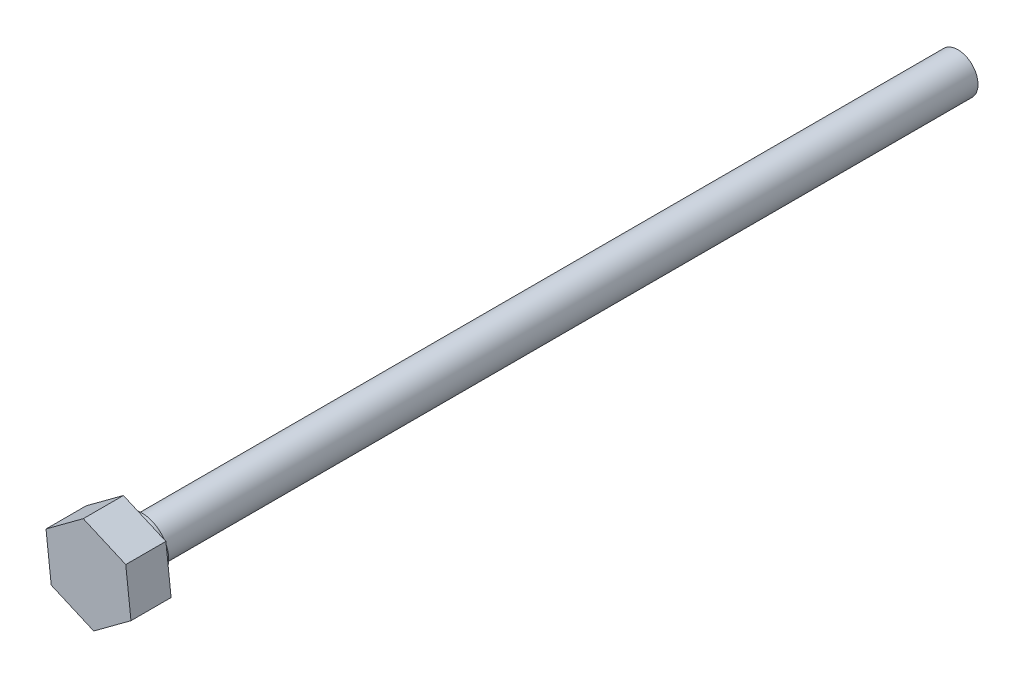
ISO-10303-21;
HEADER;
FILE_DESCRIPTION(('STEP AP214'),'2;1');
FILE_NAME('part.step','',(''),(''),'','','');
FILE_SCHEMA(('AUTOMOTIVE_DESIGN { 1 0 10303 214 1 1 1 1 }'));
ENDSEC;
DATA;
#1=APPLICATION_CONTEXT('core data for automotive mechanical design processes');
#2=APPLICATION_PROTOCOL_DEFINITION('international standard','automotive_design',2000,#1);
#3=PRODUCT_CONTEXT('',#1,'mechanical');
#4=PRODUCT('Part','Part','',(#3));
#5=PRODUCT_RELATED_PRODUCT_CATEGORY('part','',(#4));
#6=PRODUCT_DEFINITION_FORMATION('','',#4);
#7=PRODUCT_DEFINITION_CONTEXT('part definition',#1,'design');
#8=PRODUCT_DEFINITION('design','',#6,#7);
#9=PRODUCT_DEFINITION_SHAPE('','',#8);
#10=(LENGTH_UNIT() NAMED_UNIT(*) SI_UNIT(.MILLI.,.METRE.));
#11=(NAMED_UNIT(*) PLANE_ANGLE_UNIT() SI_UNIT($,.RADIAN.));
#12=(NAMED_UNIT(*) SI_UNIT($,.STERADIAN.) SOLID_ANGLE_UNIT());
#13=UNCERTAINTY_MEASURE_WITH_UNIT(LENGTH_MEASURE(1.E-05),#10,'distance_accuracy_value','');
#14=(GEOMETRIC_REPRESENTATION_CONTEXT(3) GLOBAL_UNCERTAINTY_ASSIGNED_CONTEXT((#13)) GLOBAL_UNIT_ASSIGNED_CONTEXT((#10,
#11,#12)) REPRESENTATION_CONTEXT('',''));
#15=CARTESIAN_POINT('',(0.,0.,0.));
#16=DIRECTION('',(0.,0.,1.));
#17=DIRECTION('',(1.,0.,0.));
#18=AXIS2_PLACEMENT_3D('',#15,#16,#17);
#19=CARTESIAN_POINT('',(0.,0.,-1.));
#20=DIRECTION('',(0.,0.,1.));
#21=DIRECTION('',(1.,0.,0.));
#22=AXIS2_PLACEMENT_3D('',#19,#20,#21);
#23=PLANE('',#22);
#24=CARTESIAN_POINT('',(0.,0.,-1.));
#25=DIRECTION('',(0.,0.,1.));
#26=DIRECTION('',(1.,0.,0.));
#27=AXIS2_PLACEMENT_3D('',#24,#25,#26);
#28=CIRCLE('',#27,2.);
#29=CARTESIAN_POINT('',(2.,0.,-1.));
#30=VERTEX_POINT('',#29);
#31=EDGE_CURVE('E122',#30,#30,#28,.T.);
#32=ORIENTED_EDGE('',*,*,#31,.F.);
#33=EDGE_LOOP('',(#32));
#34=FACE_BOUND('',#33,.T.);
#35=CARTESIAN_POINT('',(0.,0.,-1.));
#36=DIRECTION('',(0.,0.,1.));
#37=DIRECTION('',(1.,0.,0.));
#38=AXIS2_PLACEMENT_3D('',#35,#36,#37);
#39=CIRCLE('',#38,1.5);
#40=CARTESIAN_POINT('',(1.5,0.,-1.));
#41=VERTEX_POINT('',#40);
#42=EDGE_CURVE('E11',#41,#41,#39,.F.);
#43=ORIENTED_EDGE('',*,*,#42,.F.);
#44=EDGE_LOOP('',(#43));
#45=FACE_BOUND('',#44,.T.);
#46=ADVANCED_FACE('F32',(#34,#45),#23,.F.);
#47=CARTESIAN_POINT('',(-0.390753206713146,3.44199243628504,3.));
#48=DIRECTION('',(0.594497116587742,-0.804097741800623,0.));
#49=DIRECTION('',(0.804097741800623,0.594497116587742,0.));
#50=AXIS2_PLACEMENT_3D('',#47,#48,#49);
#51=PLANE('',#50);
#52=DIRECTION('',(-0.804097741800623,-0.594497116587742,0.));
#53=VECTOR('',#52,1.);
#54=CARTESIAN_POINT('',(-0.390753206713146,3.44199243628504,0.));
#55=LINE('',#54,#53);
#56=CARTESIAN_POINT('',(-0.390753206713146,3.44199243628504,0.));
#57=VERTEX_POINT('',#56);
#58=CARTESIAN_POINT('',(-3.17622949281331,1.3825940145187,0.));
#59=VERTEX_POINT('',#58);
#60=EDGE_CURVE('E118',#57,#59,#55,.T.);
#61=ORIENTED_EDGE('',*,*,#60,.T.);
#62=DIRECTION('',(0.,0.,-1.));
#63=VECTOR('',#62,1.);
#64=CARTESIAN_POINT('',(-3.17622949281331,1.3825940145187,3.));
#65=LINE('',#64,#63);
#66=CARTESIAN_POINT('',(-3.17622949281331,1.3825940145187,3.));
#67=VERTEX_POINT('',#66);
#68=EDGE_CURVE('E41',#67,#59,#65,.T.);
#69=ORIENTED_EDGE('',*,*,#68,.F.);
#70=DIRECTION('',(-0.804097741800623,-0.594497116587742,0.));
#71=VECTOR('',#70,1.);
#72=CARTESIAN_POINT('',(-0.390753206713146,3.44199243628504,3.));
#73=LINE('',#72,#71);
#74=CARTESIAN_POINT('',(-0.390753206713146,3.44199243628504,3.));
#75=VERTEX_POINT('',#74);
#76=EDGE_CURVE('E129',#75,#67,#73,.T.);
#77=ORIENTED_EDGE('',*,*,#76,.F.);
#78=DIRECTION('',(0.,0.,-1.));
#79=VECTOR('',#78,1.);
#80=CARTESIAN_POINT('',(-0.390753206713146,3.44199243628504,3.));
#81=LINE('',#80,#79);
#82=EDGE_CURVE('E114',#75,#57,#81,.T.);
#83=ORIENTED_EDGE('',*,*,#82,.T.);
#84=EDGE_LOOP('',(#61,#69,#77,#83));
#85=FACE_BOUND('',#84,.T.);
#86=ADVANCED_FACE('F34',(#85),#51,.F.);
#87=CARTESIAN_POINT('',(-3.17622949281331,1.3825940145187,3.));
#88=DIRECTION('',(0.99361762981891,0.112800734541272,0.));
#89=DIRECTION('',(-0.112800734541272,0.993617629818911,0.));
#90=AXIS2_PLACEMENT_3D('',#87,#88,#89);
#91=PLANE('',#90);
#92=DIRECTION('',(0.112800734541272,-0.993617629818911,0.));
#93=VECTOR('',#92,1.);
#94=CARTESIAN_POINT('',(-3.17622949281331,1.3825940145187,0.));
#95=LINE('',#94,#93);
#96=CARTESIAN_POINT('',(-2.78547628610016,-2.05939842176633,0.));
#97=VERTEX_POINT('',#96);
#98=EDGE_CURVE('E121',#59,#97,#95,.T.);
#99=ORIENTED_EDGE('',*,*,#98,.T.);
#100=DIRECTION('',(0.,0.,-1.));
#101=VECTOR('',#100,1.);
#102=CARTESIAN_POINT('',(-2.78547628610016,-2.05939842176633,3.));
#103=LINE('',#102,#101);
#104=CARTESIAN_POINT('',(-2.78547628610016,-2.05939842176633,3.));
#105=VERTEX_POINT('',#104);
#106=EDGE_CURVE('E133',#105,#97,#103,.T.);
#107=ORIENTED_EDGE('',*,*,#106,.F.);
#108=DIRECTION('',(0.112800734541272,-0.993617629818911,0.));
#109=VECTOR('',#108,1.);
#110=CARTESIAN_POINT('',(-3.17622949281331,1.3825940145187,3.));
#111=LINE('',#110,#109);
#112=EDGE_CURVE('E87',#67,#105,#111,.T.);
#113=ORIENTED_EDGE('',*,*,#112,.F.);
#114=ORIENTED_EDGE('',*,*,#68,.T.);
#115=EDGE_LOOP('',(#99,#107,#113,#114));
#116=FACE_BOUND('',#115,.T.);
#117=ADVANCED_FACE('F136',(#116),#91,.F.);
#118=CARTESIAN_POINT('',(-2.78547628610016,-2.05939842176633,3.));
#119=DIRECTION('',(0.399120513231169,0.916898476341895,0.));
#120=DIRECTION('',(-0.916898476341895,0.399120513231169,0.));
#121=AXIS2_PLACEMENT_3D('',#118,#119,#120);
#122=PLANE('',#121);
#123=DIRECTION('',(0.916898476341895,-0.399120513231169,0.));
#124=VECTOR('',#123,1.);
#125=CARTESIAN_POINT('',(-2.78547628610016,-2.05939842176633,0.));
#126=LINE('',#125,#124);
#127=CARTESIAN_POINT('',(0.390753206713146,-3.44199243628504,0.));
#128=VERTEX_POINT('',#127);
#129=EDGE_CURVE('E124',#97,#128,#126,.T.);
#130=ORIENTED_EDGE('',*,*,#129,.T.);
#131=DIRECTION('',(0.,0.,-1.));
#132=VECTOR('',#131,1.);
#133=CARTESIAN_POINT('',(0.390753206713146,-3.44199243628504,3.));
#134=LINE('',#133,#132);
#135=CARTESIAN_POINT('',(0.390753206713146,-3.44199243628504,3.));
#136=VERTEX_POINT('',#135);
#137=EDGE_CURVE('E109',#136,#128,#134,.T.);
#138=ORIENTED_EDGE('',*,*,#137,.F.);
#139=DIRECTION('',(0.916898476341895,-0.399120513231169,0.));
#140=VECTOR('',#139,1.);
#141=CARTESIAN_POINT('',(-2.78547628610016,-2.05939842176633,3.));
#142=LINE('',#141,#140);
#143=EDGE_CURVE('E100',#105,#136,#142,.T.);
#144=ORIENTED_EDGE('',*,*,#143,.F.);
#145=ORIENTED_EDGE('',*,*,#106,.T.);
#146=EDGE_LOOP('',(#130,#138,#144,#145));
#147=FACE_BOUND('',#146,.T.);
#148=ADVANCED_FACE('F144',(#147),#122,.F.);
#149=CARTESIAN_POINT('',(0.390753206713146,-3.44199243628504,3.));
#150=DIRECTION('',(-0.594497116587742,0.804097741800623,0.));
#151=DIRECTION('',(-0.804097741800623,-0.594497116587742,0.));
#152=AXIS2_PLACEMENT_3D('',#149,#150,#151);
#153=PLANE('',#152);
#154=DIRECTION('',(0.804097741800623,0.594497116587742,0.));
#155=VECTOR('',#154,1.);
#156=CARTESIAN_POINT('',(0.390753206713146,-3.44199243628504,0.));
#157=LINE('',#156,#155);
#158=CARTESIAN_POINT('',(3.1762294928133,-1.3825940145187,0.));
#159=VERTEX_POINT('',#158);
#160=EDGE_CURVE('E108',#128,#159,#157,.T.);
#161=ORIENTED_EDGE('',*,*,#160,.T.);
#162=DIRECTION('',(0.,0.,-1.));
#163=VECTOR('',#162,1.);
#164=CARTESIAN_POINT('',(3.1762294928133,-1.3825940145187,3.));
#165=LINE('',#164,#163);
#166=CARTESIAN_POINT('',(3.1762294928133,-1.3825940145187,3.));
#167=VERTEX_POINT('',#166);
#168=EDGE_CURVE('E105',#167,#159,#165,.T.);
#169=ORIENTED_EDGE('',*,*,#168,.F.);
#170=DIRECTION('',(0.804097741800623,0.594497116587742,0.));
#171=VECTOR('',#170,1.);
#172=CARTESIAN_POINT('',(0.390753206713146,-3.44199243628504,3.));
#173=LINE('',#172,#171);
#174=EDGE_CURVE('E94',#136,#167,#173,.T.);
#175=ORIENTED_EDGE('',*,*,#174,.F.);
#176=ORIENTED_EDGE('',*,*,#137,.T.);
#177=EDGE_LOOP('',(#161,#169,#175,#176));
#178=FACE_BOUND('',#177,.T.);
#179=ADVANCED_FACE('F106',(#178),#153,.F.);
#180=CARTESIAN_POINT('',(3.1762294928133,-1.3825940145187,3.));
#181=DIRECTION('',(-0.99361762981891,-0.112800734541272,0.));
#182=DIRECTION('',(0.112800734541272,-0.993617629818911,0.));
#183=AXIS2_PLACEMENT_3D('',#180,#181,#182);
#184=PLANE('',#183);
#185=DIRECTION('',(-0.112800734541272,0.993617629818911,0.));
#186=VECTOR('',#185,1.);
#187=CARTESIAN_POINT('',(3.1762294928133,-1.3825940145187,0.));
#188=LINE('',#187,#186);
#189=CARTESIAN_POINT('',(2.78547628610016,2.05939842176634,0.));
#190=VERTEX_POINT('',#189);
#191=EDGE_CURVE('E72',#159,#190,#188,.T.);
#192=ORIENTED_EDGE('',*,*,#191,.T.);
#193=DIRECTION('',(0.,0.,-1.));
#194=VECTOR('',#193,1.);
#195=CARTESIAN_POINT('',(2.78547628610016,2.05939842176634,3.));
#196=LINE('',#195,#194);
#197=CARTESIAN_POINT('',(2.78547628610016,2.05939842176634,3.));
#198=VERTEX_POINT('',#197);
#199=EDGE_CURVE('E110',#198,#190,#196,.T.);
#200=ORIENTED_EDGE('',*,*,#199,.F.);
#201=DIRECTION('',(-0.112800734541272,0.993617629818911,0.));
#202=VECTOR('',#201,1.);
#203=CARTESIAN_POINT('',(3.1762294928133,-1.3825940145187,3.));
#204=LINE('',#203,#202);
#205=EDGE_CURVE('E98',#167,#198,#204,.T.);
#206=ORIENTED_EDGE('',*,*,#205,.F.);
#207=ORIENTED_EDGE('',*,*,#168,.T.);
#208=EDGE_LOOP('',(#192,#200,#206,#207));
#209=FACE_BOUND('',#208,.T.);
#210=ADVANCED_FACE('F112',(#209),#184,.F.);
#211=CARTESIAN_POINT('',(2.78547628610016,2.05939842176634,3.));
#212=DIRECTION('',(-0.399120513231169,-0.916898476341895,0.));
#213=DIRECTION('',(0.916898476341895,-0.399120513231169,0.));
#214=AXIS2_PLACEMENT_3D('',#211,#212,#213);
#215=PLANE('',#214);
#216=DIRECTION('',(-0.916898476341895,0.399120513231169,0.));
#217=VECTOR('',#216,1.);
#218=CARTESIAN_POINT('',(2.78547628610016,2.05939842176634,0.));
#219=LINE('',#218,#217);
#220=EDGE_CURVE('E78',#190,#57,#219,.T.);
#221=ORIENTED_EDGE('',*,*,#220,.T.);
#222=ORIENTED_EDGE('',*,*,#82,.F.);
#223=DIRECTION('',(-0.916898476341895,0.399120513231169,0.));
#224=VECTOR('',#223,1.);
#225=CARTESIAN_POINT('',(2.78547628610016,2.05939842176634,3.));
#226=LINE('',#225,#224);
#227=EDGE_CURVE('E49',#198,#75,#226,.T.);
#228=ORIENTED_EDGE('',*,*,#227,.F.);
#229=ORIENTED_EDGE('',*,*,#199,.T.);
#230=EDGE_LOOP('',(#221,#222,#228,#229));
#231=FACE_BOUND('',#230,.T.);
#232=ADVANCED_FACE('F180',(#231),#215,.F.);
#233=CARTESIAN_POINT('',(0.,0.,3.));
#234=DIRECTION('',(0.,0.,1.));
#235=DIRECTION('',(1.,0.,0.));
#236=AXIS2_PLACEMENT_3D('',#233,#234,#235);
#237=PLANE('',#236);
#238=ORIENTED_EDGE('',*,*,#76,.T.);
#239=ORIENTED_EDGE('',*,*,#112,.T.);
#240=ORIENTED_EDGE('',*,*,#143,.T.);
#241=ORIENTED_EDGE('',*,*,#174,.T.);
#242=ORIENTED_EDGE('',*,*,#205,.T.);
#243=ORIENTED_EDGE('',*,*,#227,.T.);
#244=EDGE_LOOP('',(#238,#239,#240,#241,#242,#243));
#245=FACE_BOUND('',#244,.T.);
#246=ADVANCED_FACE('F96',(#245),#237,.T.);
#247=CARTESIAN_POINT('',(0.,0.,0.));
#248=DIRECTION('',(0.,0.,1.));
#249=DIRECTION('',(1.,0.,0.));
#250=AXIS2_PLACEMENT_3D('',#247,#248,#249);
#251=PLANE('',#250);
#252=CARTESIAN_POINT('',(0.,0.,0.));
#253=DIRECTION('',(0.,0.,1.));
#254=DIRECTION('',(1.,0.,0.));
#255=AXIS2_PLACEMENT_3D('',#252,#253,#254);
#256=CIRCLE('',#255,2.);
#257=CARTESIAN_POINT('',(2.,0.,0.));
#258=VERTEX_POINT('',#257);
#259=EDGE_CURVE('E148',#258,#258,#256,.T.);
#260=ORIENTED_EDGE('',*,*,#259,.T.);
#261=EDGE_LOOP('',(#260));
#262=FACE_BOUND('',#261,.T.);
#263=ORIENTED_EDGE('',*,*,#60,.F.);
#264=ORIENTED_EDGE('',*,*,#220,.F.);
#265=ORIENTED_EDGE('',*,*,#191,.F.);
#266=ORIENTED_EDGE('',*,*,#160,.F.);
#267=ORIENTED_EDGE('',*,*,#129,.F.);
#268=ORIENTED_EDGE('',*,*,#98,.F.);
#269=EDGE_LOOP('',(#263,#264,#265,#266,#267,#268));
#270=FACE_BOUND('',#269,.T.);
#271=ADVANCED_FACE('F141',(#262,#270),#251,.F.);
#272=CARTESIAN_POINT('',(0.,0.,-1.));
#273=DIRECTION('',(0.,0.,1.));
#274=DIRECTION('',(1.,0.,0.));
#275=AXIS2_PLACEMENT_3D('',#272,#273,#274);
#276=CYLINDRICAL_SURFACE('',#275,2.);
#277=ORIENTED_EDGE('',*,*,#31,.T.);
#278=EDGE_LOOP('',(#277));
#279=FACE_BOUND('',#278,.T.);
#280=ORIENTED_EDGE('',*,*,#259,.F.);
#281=EDGE_LOOP('',(#280));
#282=FACE_BOUND('',#281,.T.);
#283=ADVANCED_FACE('F162',(#279,#282),#276,.T.);
#284=CARTESIAN_POINT('',(0.,0.,-62.));
#285=DIRECTION('',(0.,0.,1.));
#286=DIRECTION('',(1.,0.,0.));
#287=AXIS2_PLACEMENT_3D('',#284,#285,#286);
#288=CYLINDRICAL_SURFACE('',#287,1.5);
#289=CARTESIAN_POINT('',(0.,0.,-62.));
#290=DIRECTION('',(0.,0.,-1.));
#291=DIRECTION('',(-1.,0.,0.));
#292=AXIS2_PLACEMENT_3D('',#289,#290,#291);
#293=CIRCLE('',#292,1.5);
#294=CARTESIAN_POINT('',(-1.5,0.,-62.));
#295=VERTEX_POINT('',#294);
#296=EDGE_CURVE('E151',#295,#295,#293,.T.);
#297=ORIENTED_EDGE('',*,*,#296,.F.);
#298=EDGE_LOOP('',(#297));
#299=FACE_BOUND('',#298,.T.);
#300=ORIENTED_EDGE('',*,*,#42,.T.);
#301=EDGE_LOOP('',(#300));
#302=FACE_BOUND('',#301,.T.);
#303=ADVANCED_FACE('F159',(#299,#302),#288,.T.);
#304=CARTESIAN_POINT('',(0.,0.,-62.));
#305=DIRECTION('',(0.,0.,-1.));
#306=DIRECTION('',(-1.,0.,0.));
#307=AXIS2_PLACEMENT_3D('',#304,#305,#306);
#308=PLANE('',#307);
#309=ORIENTED_EDGE('',*,*,#296,.T.);
#310=EDGE_LOOP('',(#309));
#311=FACE_BOUND('',#310,.T.);
#312=ADVANCED_FACE('F157',(#311),#308,.T.);
#313=CLOSED_SHELL('',(#46,#86,#117,#148,#179,#210,#232,#246,#271,#283,#303,#312));
#314=MANIFOLD_SOLID_BREP('B2',#313);
#315=ADVANCED_BREP_SHAPE_REPRESENTATION('',(#18,#314),#14);
#316=SHAPE_DEFINITION_REPRESENTATION(#9,#315);
ENDSEC;
END-ISO-10303-21;
